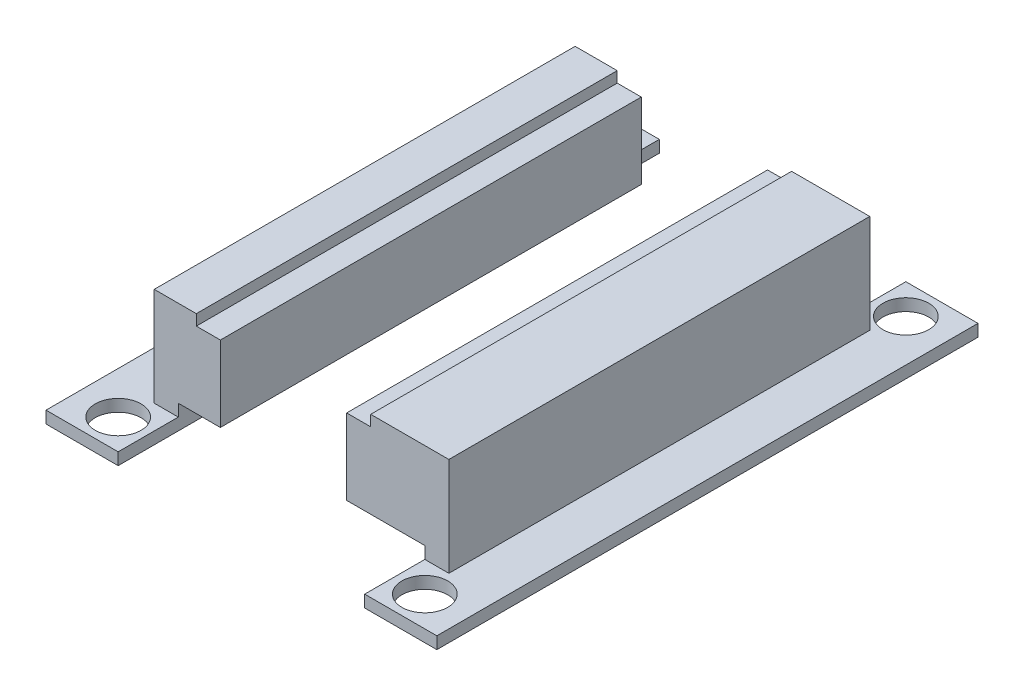
ISO-10303-21;
HEADER;
FILE_DESCRIPTION(('STEP AP214'),'2;1');
FILE_NAME('part.step','',(''),(''),'','','');
FILE_SCHEMA(('AUTOMOTIVE_DESIGN { 1 0 10303 214 1 1 1 1 }'));
ENDSEC;
DATA;
#1=APPLICATION_CONTEXT('core data for automotive mechanical design processes');
#2=APPLICATION_PROTOCOL_DEFINITION('international standard','automotive_design',2000,#1);
#3=PRODUCT_CONTEXT('',#1,'mechanical');
#4=PRODUCT('Part','Part','',(#3));
#5=PRODUCT_RELATED_PRODUCT_CATEGORY('part','',(#4));
#6=PRODUCT_DEFINITION_FORMATION('','',#4);
#7=PRODUCT_DEFINITION_CONTEXT('part definition',#1,'design');
#8=PRODUCT_DEFINITION('design','',#6,#7);
#9=PRODUCT_DEFINITION_SHAPE('','',#8);
#10=(LENGTH_UNIT() NAMED_UNIT(*) SI_UNIT(.MILLI.,.METRE.));
#11=(NAMED_UNIT(*) PLANE_ANGLE_UNIT() SI_UNIT($,.RADIAN.));
#12=(NAMED_UNIT(*) SI_UNIT($,.STERADIAN.) SOLID_ANGLE_UNIT());
#13=UNCERTAINTY_MEASURE_WITH_UNIT(LENGTH_MEASURE(1.E-05),#10,'distance_accuracy_value','');
#14=(GEOMETRIC_REPRESENTATION_CONTEXT(3) GLOBAL_UNCERTAINTY_ASSIGNED_CONTEXT((#13)) GLOBAL_UNIT_ASSIGNED_CONTEXT((#10,
#11,#12)) REPRESENTATION_CONTEXT('',''));
#15=CARTESIAN_POINT('',(0.,0.,0.));
#16=DIRECTION('',(0.,0.,1.));
#17=DIRECTION('',(1.,0.,0.));
#18=AXIS2_PLACEMENT_3D('',#15,#16,#17);
#19=CARTESIAN_POINT('',(16.25,0.,45.));
#20=DIRECTION('',(0.,1.,0.));
#21=DIRECTION('',(-1.,0.,0.));
#22=AXIS2_PLACEMENT_3D('',#19,#20,#21);
#23=PLANE('',#22);
#24=CARTESIAN_POINT('',(12.75,0.,2.5));
#25=DIRECTION('',(0.,1.,0.));
#26=DIRECTION('',(-1.,0.,0.));
#27=AXIS2_PLACEMENT_3D('',#24,#25,#26);
#28=CIRCLE('',#27,1.905);
#29=CARTESIAN_POINT('',(10.845,0.,2.5));
#30=VERTEX_POINT('',#29);
#31=EDGE_CURVE('E490',#30,#30,#28,.T.);
#32=ORIENTED_EDGE('',*,*,#31,.T.);
#33=EDGE_LOOP('',(#32));
#34=FACE_BOUND('',#33,.T.);
#35=CARTESIAN_POINT('',(12.75,0.,42.5));
#36=DIRECTION('',(0.,1.,0.));
#37=DIRECTION('',(-1.,0.,0.));
#38=AXIS2_PLACEMENT_3D('',#35,#36,#37);
#39=CIRCLE('',#38,1.905);
#40=CARTESIAN_POINT('',(10.845,0.,42.5));
#41=VERTEX_POINT('',#40);
#42=EDGE_CURVE('E263',#41,#41,#39,.T.);
#43=ORIENTED_EDGE('',*,*,#42,.T.);
#44=EDGE_LOOP('',(#43));
#45=FACE_BOUND('',#44,.T.);
#46=DIRECTION('',(1.,0.,0.));
#47=VECTOR('',#46,1.);
#48=CARTESIAN_POINT('',(16.25,0.,0.));
#49=LINE('',#48,#47);
#50=CARTESIAN_POINT('',(10.25,0.,0.));
#51=VERTEX_POINT('',#50);
#52=CARTESIAN_POINT('',(16.25,0.,0.));
#53=VERTEX_POINT('',#52);
#54=EDGE_CURVE('E220',#51,#53,#49,.T.);
#55=ORIENTED_EDGE('',*,*,#54,.T.);
#56=DIRECTION('',(0.,0.,-1.));
#57=VECTOR('',#56,1.);
#58=CARTESIAN_POINT('',(16.25,0.,45.));
#59=LINE('',#58,#57);
#60=CARTESIAN_POINT('',(16.25,0.,45.));
#61=VERTEX_POINT('',#60);
#62=EDGE_CURVE('E295',#61,#53,#59,.T.);
#63=ORIENTED_EDGE('',*,*,#62,.F.);
#64=DIRECTION('',(1.,0.,0.));
#65=VECTOR('',#64,1.);
#66=CARTESIAN_POINT('',(16.25,0.,45.));
#67=LINE('',#66,#65);
#68=CARTESIAN_POINT('',(10.25,0.,45.));
#69=VERTEX_POINT('',#68);
#70=EDGE_CURVE('E215',#69,#61,#67,.T.);
#71=ORIENTED_EDGE('',*,*,#70,.F.);
#72=DIRECTION('',(0.,0.,-1.));
#73=VECTOR('',#72,1.);
#74=CARTESIAN_POINT('',(10.25,0.,45.));
#75=LINE('',#74,#73);
#76=EDGE_CURVE('E208',#69,#51,#75,.T.);
#77=ORIENTED_EDGE('',*,*,#76,.T.);
#78=EDGE_LOOP('',(#55,#63,#71,#77));
#79=FACE_BOUND('',#78,.T.);
#80=ADVANCED_FACE('F53',(#34,#45,#79),#23,.F.);
#81=CARTESIAN_POINT('',(16.25,1.,45.));
#82=DIRECTION('',(-1.,0.,0.));
#83=DIRECTION('',(0.,0.,1.));
#84=AXIS2_PLACEMENT_3D('',#81,#82,#83);
#85=PLANE('',#84);
#86=DIRECTION('',(0.,1.,0.));
#87=VECTOR('',#86,1.);
#88=CARTESIAN_POINT('',(16.25,1.,0.));
#89=LINE('',#88,#87);
#90=CARTESIAN_POINT('',(16.25,1.,0.));
#91=VERTEX_POINT('',#90);
#92=EDGE_CURVE('E78',#53,#91,#89,.T.);
#93=ORIENTED_EDGE('',*,*,#92,.T.);
#94=DIRECTION('',(0.,0.,-1.));
#95=VECTOR('',#94,1.);
#96=CARTESIAN_POINT('',(16.25,1.,45.));
#97=LINE('',#96,#95);
#98=CARTESIAN_POINT('',(16.25,1.,45.));
#99=VERTEX_POINT('',#98);
#100=EDGE_CURVE('E189',#99,#91,#97,.T.);
#101=ORIENTED_EDGE('',*,*,#100,.F.);
#102=DIRECTION('',(0.,1.,0.));
#103=VECTOR('',#102,1.);
#104=CARTESIAN_POINT('',(16.25,1.,45.));
#105=LINE('',#104,#103);
#106=EDGE_CURVE('E92',#61,#99,#105,.T.);
#107=ORIENTED_EDGE('',*,*,#106,.F.);
#108=ORIENTED_EDGE('',*,*,#62,.T.);
#109=EDGE_LOOP('',(#93,#101,#107,#108));
#110=FACE_BOUND('',#109,.T.);
#111=ADVANCED_FACE('F313',(#110),#85,.F.);
#112=CARTESIAN_POINT('',(12.25,1.,45.));
#113=DIRECTION('',(0.,-1.,0.));
#114=DIRECTION('',(1.,0.,0.));
#115=AXIS2_PLACEMENT_3D('',#112,#113,#114);
#116=PLANE('',#115);
#117=CARTESIAN_POINT('',(12.75,1.,2.5));
#118=DIRECTION('',(0.,1.,0.));
#119=DIRECTION('',(-1.,0.,0.));
#120=AXIS2_PLACEMENT_3D('',#117,#118,#119);
#121=CIRCLE('',#120,1.905);
#122=CARTESIAN_POINT('',(10.845,1.,2.5));
#123=VERTEX_POINT('',#122);
#124=EDGE_CURVE('E177',#123,#123,#121,.T.);
#125=ORIENTED_EDGE('',*,*,#124,.F.);
#126=EDGE_LOOP('',(#125));
#127=FACE_BOUND('',#126,.T.);
#128=CARTESIAN_POINT('',(12.75,1.,42.5));
#129=DIRECTION('',(0.,1.,0.));
#130=DIRECTION('',(-1.,0.,0.));
#131=AXIS2_PLACEMENT_3D('',#128,#129,#130);
#132=CIRCLE('',#131,1.905);
#133=CARTESIAN_POINT('',(10.845,1.,42.5));
#134=VERTEX_POINT('',#133);
#135=EDGE_CURVE('E264',#134,#134,#132,.T.);
#136=ORIENTED_EDGE('',*,*,#135,.F.);
#137=EDGE_LOOP('',(#136));
#138=FACE_BOUND('',#137,.T.);
#139=DIRECTION('',(-1.,0.,0.));
#140=VECTOR('',#139,1.);
#141=CARTESIAN_POINT('',(12.25,1.,0.));
#142=LINE('',#141,#140);
#143=CARTESIAN_POINT('',(10.25,0.999999999999999,0.));
#144=VERTEX_POINT('',#143);
#145=EDGE_CURVE('E214',#91,#144,#142,.T.);
#146=ORIENTED_EDGE('',*,*,#145,.T.);
#147=DIRECTION('',(0.,0.,-1.));
#148=VECTOR('',#147,1.);
#149=CARTESIAN_POINT('',(10.25,0.999999999999999,45.));
#150=LINE('',#149,#148);
#151=CARTESIAN_POINT('',(10.25,0.999999999999999,5.));
#152=VERTEX_POINT('',#151);
#153=EDGE_CURVE('E250',#152,#144,#150,.T.);
#154=ORIENTED_EDGE('',*,*,#153,.F.);
#155=DIRECTION('',(1.,0.,0.));
#156=VECTOR('',#155,1.);
#157=CARTESIAN_POINT('',(-16.25,0.999999999999993,5.));
#158=LINE('',#157,#156);
#159=CARTESIAN_POINT('',(12.25,0.999999999999999,5.));
#160=VERTEX_POINT('',#159);
#161=EDGE_CURVE('E167',#152,#160,#158,.T.);
#162=ORIENTED_EDGE('',*,*,#161,.T.);
#163=DIRECTION('',(0.,0.,-1.));
#164=VECTOR('',#163,1.);
#165=CARTESIAN_POINT('',(12.25,1.,45.));
#166=LINE('',#165,#164);
#167=CARTESIAN_POINT('',(12.25,1.,40.));
#168=VERTEX_POINT('',#167);
#169=EDGE_CURVE('E175',#168,#160,#166,.T.);
#170=ORIENTED_EDGE('',*,*,#169,.F.);
#171=DIRECTION('',(1.,0.,0.));
#172=VECTOR('',#171,1.);
#173=CARTESIAN_POINT('',(-16.25,0.999999999999994,40.));
#174=LINE('',#173,#172);
#175=CARTESIAN_POINT('',(10.25,1.,40.));
#176=VERTEX_POINT('',#175);
#177=EDGE_CURVE('E274',#176,#168,#174,.T.);
#178=ORIENTED_EDGE('',*,*,#177,.F.);
#179=DIRECTION('',(0.,0.,-1.));
#180=VECTOR('',#179,1.);
#181=CARTESIAN_POINT('',(10.25,1.,45.));
#182=LINE('',#181,#180);
#183=CARTESIAN_POINT('',(10.25,0.999999999999999,45.));
#184=VERTEX_POINT('',#183);
#185=EDGE_CURVE('E237',#184,#176,#182,.T.);
#186=ORIENTED_EDGE('',*,*,#185,.F.);
#187=DIRECTION('',(-1.,0.,0.));
#188=VECTOR('',#187,1.);
#189=CARTESIAN_POINT('',(12.25,1.,45.));
#190=LINE('',#189,#188);
#191=EDGE_CURVE('E69',#99,#184,#190,.T.);
#192=ORIENTED_EDGE('',*,*,#191,.F.);
#193=ORIENTED_EDGE('',*,*,#100,.T.);
#194=EDGE_LOOP('',(#146,#154,#162,#170,#178,#186,#192,#193));
#195=FACE_BOUND('',#194,.T.);
#196=ADVANCED_FACE('F300',(#127,#138,#195),#116,.F.);
#197=CARTESIAN_POINT('',(12.25,9.2,45.));
#198=DIRECTION('',(-1.,0.,0.));
#199=DIRECTION('',(0.,-1.,0.));
#200=AXIS2_PLACEMENT_3D('',#197,#198,#199);
#201=PLANE('',#200);
#202=ORIENTED_EDGE('',*,*,#169,.T.);
#203=DIRECTION('',(0.,-1.,0.));
#204=VECTOR('',#203,1.);
#205=CARTESIAN_POINT('',(12.25,0.999999999999999,5.));
#206=LINE('',#205,#204);
#207=CARTESIAN_POINT('',(12.25,9.2,5.));
#208=VERTEX_POINT('',#207);
#209=EDGE_CURVE('E158',#208,#160,#206,.T.);
#210=ORIENTED_EDGE('',*,*,#209,.F.);
#211=DIRECTION('',(0.,0.,-1.));
#212=VECTOR('',#211,1.);
#213=CARTESIAN_POINT('',(12.25,9.2,45.));
#214=LINE('',#213,#212);
#215=CARTESIAN_POINT('',(12.25,9.2,40.));
#216=VERTEX_POINT('',#215);
#217=EDGE_CURVE('E173',#216,#208,#214,.T.);
#218=ORIENTED_EDGE('',*,*,#217,.F.);
#219=DIRECTION('',(0.,1.,0.));
#220=VECTOR('',#219,1.);
#221=CARTESIAN_POINT('',(12.25,1.,40.));
#222=LINE('',#221,#220);
#223=EDGE_CURVE('E268',#168,#216,#222,.T.);
#224=ORIENTED_EDGE('',*,*,#223,.F.);
#225=EDGE_LOOP('',(#202,#210,#218,#224));
#226=FACE_BOUND('',#225,.T.);
#227=ADVANCED_FACE('F171',(#226),#201,.F.);
#228=CARTESIAN_POINT('',(5.75,9.2,45.));
#229=DIRECTION('',(0.,-1.,0.));
#230=DIRECTION('',(0.,0.,-1.));
#231=AXIS2_PLACEMENT_3D('',#228,#229,#230);
#232=PLANE('',#231);
#233=ORIENTED_EDGE('',*,*,#217,.T.);
#234=DIRECTION('',(1.,0.,0.));
#235=VECTOR('',#234,1.);
#236=CARTESIAN_POINT('',(-16.25,9.19999999999999,5.));
#237=LINE('',#236,#235);
#238=CARTESIAN_POINT('',(5.75,9.2,5.));
#239=VERTEX_POINT('',#238);
#240=EDGE_CURVE('E154',#239,#208,#237,.T.);
#241=ORIENTED_EDGE('',*,*,#240,.F.);
#242=DIRECTION('',(0.,0.,-1.));
#243=VECTOR('',#242,1.);
#244=CARTESIAN_POINT('',(5.75,9.2,45.));
#245=LINE('',#244,#243);
#246=CARTESIAN_POINT('',(5.75,9.2,40.));
#247=VERTEX_POINT('',#246);
#248=EDGE_CURVE('E183',#247,#239,#245,.T.);
#249=ORIENTED_EDGE('',*,*,#248,.F.);
#250=DIRECTION('',(1.,0.,0.));
#251=VECTOR('',#250,1.);
#252=CARTESIAN_POINT('',(-16.25,9.19999999999999,40.));
#253=LINE('',#252,#251);
#254=EDGE_CURVE('E181',#247,#216,#253,.T.);
#255=ORIENTED_EDGE('',*,*,#254,.T.);
#256=EDGE_LOOP('',(#233,#241,#249,#255));
#257=FACE_BOUND('',#256,.T.);
#258=ADVANCED_FACE('F180',(#257),#232,.F.);
#259=CARTESIAN_POINT('',(5.75,8.3,45.));
#260=DIRECTION('',(1.,0.,0.));
#261=DIRECTION('',(0.,0.,-1.));
#262=AXIS2_PLACEMENT_3D('',#259,#260,#261);
#263=PLANE('',#262);
#264=ORIENTED_EDGE('',*,*,#248,.T.);
#265=DIRECTION('',(0.,-1.,0.));
#266=VECTOR('',#265,1.);
#267=CARTESIAN_POINT('',(5.75,8.3,5.));
#268=LINE('',#267,#266);
#269=CARTESIAN_POINT('',(5.75,8.3,5.));
#270=VERTEX_POINT('',#269);
#271=EDGE_CURVE('E161',#239,#270,#268,.T.);
#272=ORIENTED_EDGE('',*,*,#271,.T.);
#273=DIRECTION('',(0.,0.,-1.));
#274=VECTOR('',#273,1.);
#275=CARTESIAN_POINT('',(5.75,8.3,45.));
#276=LINE('',#275,#274);
#277=CARTESIAN_POINT('',(5.75,8.3,40.));
#278=VERTEX_POINT('',#277);
#279=EDGE_CURVE('E187',#278,#270,#276,.T.);
#280=ORIENTED_EDGE('',*,*,#279,.F.);
#281=DIRECTION('',(0.,1.,0.));
#282=VECTOR('',#281,1.);
#283=CARTESIAN_POINT('',(5.75,8.3,40.));
#284=LINE('',#283,#282);
#285=EDGE_CURVE('E291',#278,#247,#284,.T.);
#286=ORIENTED_EDGE('',*,*,#285,.T.);
#287=EDGE_LOOP('',(#264,#272,#280,#286));
#288=FACE_BOUND('',#287,.T.);
#289=ADVANCED_FACE('F332',(#288),#263,.F.);
#290=CARTESIAN_POINT('',(3.75,8.3,45.));
#291=DIRECTION('',(0.,-1.,0.));
#292=DIRECTION('',(0.,0.,-1.));
#293=AXIS2_PLACEMENT_3D('',#290,#291,#292);
#294=PLANE('',#293);
#295=ORIENTED_EDGE('',*,*,#279,.T.);
#296=DIRECTION('',(-1.,0.,0.));
#297=VECTOR('',#296,1.);
#298=CARTESIAN_POINT('',(3.75,8.3,5.));
#299=LINE('',#298,#297);
#300=CARTESIAN_POINT('',(3.75,8.3,5.));
#301=VERTEX_POINT('',#300);
#302=EDGE_CURVE('E254',#270,#301,#299,.T.);
#303=ORIENTED_EDGE('',*,*,#302,.T.);
#304=DIRECTION('',(0.,0.,-1.));
#305=VECTOR('',#304,1.);
#306=CARTESIAN_POINT('',(3.75,8.3,45.));
#307=LINE('',#306,#305);
#308=CARTESIAN_POINT('',(3.75,8.3,40.));
#309=VERTEX_POINT('',#308);
#310=EDGE_CURVE('E196',#309,#301,#307,.T.);
#311=ORIENTED_EDGE('',*,*,#310,.F.);
#312=DIRECTION('',(1.,0.,0.));
#313=VECTOR('',#312,1.);
#314=CARTESIAN_POINT('',(3.75,8.3,40.));
#315=LINE('',#314,#313);
#316=EDGE_CURVE('E287',#309,#278,#315,.T.);
#317=ORIENTED_EDGE('',*,*,#316,.T.);
#318=EDGE_LOOP('',(#295,#303,#311,#317));
#319=FACE_BOUND('',#318,.T.);
#320=ADVANCED_FACE('F335',(#319),#294,.F.);
#321=CARTESIAN_POINT('',(3.75,2.,45.));
#322=DIRECTION('',(1.,0.,0.));
#323=DIRECTION('',(0.,0.,-1.));
#324=AXIS2_PLACEMENT_3D('',#321,#322,#323);
#325=PLANE('',#324);
#326=ORIENTED_EDGE('',*,*,#310,.T.);
#327=DIRECTION('',(0.,-1.,0.));
#328=VECTOR('',#327,1.);
#329=CARTESIAN_POINT('',(3.75,2.,5.));
#330=LINE('',#329,#328);
#331=CARTESIAN_POINT('',(3.75,2.,5.));
#332=VERTEX_POINT('',#331);
#333=EDGE_CURVE('E249',#301,#332,#330,.T.);
#334=ORIENTED_EDGE('',*,*,#333,.T.);
#335=DIRECTION('',(0.,0.,-1.));
#336=VECTOR('',#335,1.);
#337=CARTESIAN_POINT('',(3.75,2.,45.));
#338=LINE('',#337,#336);
#339=CARTESIAN_POINT('',(3.75,2.,40.));
#340=VERTEX_POINT('',#339);
#341=EDGE_CURVE('E200',#340,#332,#338,.T.);
#342=ORIENTED_EDGE('',*,*,#341,.F.);
#343=DIRECTION('',(0.,1.,0.));
#344=VECTOR('',#343,1.);
#345=CARTESIAN_POINT('',(3.75,2.,40.));
#346=LINE('',#345,#344);
#347=EDGE_CURVE('E283',#340,#309,#346,.T.);
#348=ORIENTED_EDGE('',*,*,#347,.T.);
#349=EDGE_LOOP('',(#326,#334,#342,#348));
#350=FACE_BOUND('',#349,.T.);
#351=ADVANCED_FACE('F339',(#350),#325,.F.);
#352=CARTESIAN_POINT('',(10.25,2.,45.));
#353=DIRECTION('',(0.,1.,0.));
#354=DIRECTION('',(-1.,0.,0.));
#355=AXIS2_PLACEMENT_3D('',#352,#353,#354);
#356=PLANE('',#355);
#357=ORIENTED_EDGE('',*,*,#341,.T.);
#358=DIRECTION('',(1.,0.,0.));
#359=VECTOR('',#358,1.);
#360=CARTESIAN_POINT('',(10.25,2.,5.));
#361=LINE('',#360,#359);
#362=CARTESIAN_POINT('',(10.25,2.,5.));
#363=VERTEX_POINT('',#362);
#364=EDGE_CURVE('E246',#332,#363,#361,.T.);
#365=ORIENTED_EDGE('',*,*,#364,.T.);
#366=DIRECTION('',(0.,0.,-1.));
#367=VECTOR('',#366,1.);
#368=CARTESIAN_POINT('',(10.25,2.,45.));
#369=LINE('',#368,#367);
#370=CARTESIAN_POINT('',(10.25,2.,40.));
#371=VERTEX_POINT('',#370);
#372=EDGE_CURVE('E204',#371,#363,#369,.T.);
#373=ORIENTED_EDGE('',*,*,#372,.F.);
#374=DIRECTION('',(-1.,0.,0.));
#375=VECTOR('',#374,1.);
#376=CARTESIAN_POINT('',(10.25,2.,40.));
#377=LINE('',#376,#375);
#378=EDGE_CURVE('E244',#371,#340,#377,.T.);
#379=ORIENTED_EDGE('',*,*,#378,.T.);
#380=EDGE_LOOP('',(#357,#365,#373,#379));
#381=FACE_BOUND('',#380,.T.);
#382=ADVANCED_FACE('F243',(#381),#356,.F.);
#383=CARTESIAN_POINT('',(10.25,0.,45.));
#384=DIRECTION('',(1.,0.,0.));
#385=DIRECTION('',(0.,0.,-1.));
#386=AXIS2_PLACEMENT_3D('',#383,#384,#385);
#387=PLANE('',#386);
#388=DIRECTION('',(0.,-1.,0.));
#389=VECTOR('',#388,1.);
#390=CARTESIAN_POINT('',(10.25,0.,5.));
#391=LINE('',#390,#389);
#392=EDGE_CURVE('E12',#363,#152,#391,.T.);
#393=ORIENTED_EDGE('',*,*,#392,.T.);
#394=ORIENTED_EDGE('',*,*,#153,.T.);
#395=DIRECTION('',(0.,-1.,0.));
#396=VECTOR('',#395,1.);
#397=CARTESIAN_POINT('',(10.25,0.,0.));
#398=LINE('',#397,#396);
#399=EDGE_CURVE('E99',#144,#51,#398,.T.);
#400=ORIENTED_EDGE('',*,*,#399,.T.);
#401=ORIENTED_EDGE('',*,*,#76,.F.);
#402=DIRECTION('',(0.,-1.,0.));
#403=VECTOR('',#402,1.);
#404=CARTESIAN_POINT('',(10.25,0.,45.));
#405=LINE('',#404,#403);
#406=EDGE_CURVE('E211',#184,#69,#405,.T.);
#407=ORIENTED_EDGE('',*,*,#406,.F.);
#408=ORIENTED_EDGE('',*,*,#185,.T.);
#409=DIRECTION('',(0.,1.,0.));
#410=VECTOR('',#409,1.);
#411=CARTESIAN_POINT('',(10.25,0.,40.));
#412=LINE('',#411,#410);
#413=EDGE_CURVE('E62',#176,#371,#412,.T.);
#414=ORIENTED_EDGE('',*,*,#413,.T.);
#415=ORIENTED_EDGE('',*,*,#372,.T.);
#416=EDGE_LOOP('',(#393,#394,#400,#401,#407,#408,#414,#415));
#417=FACE_BOUND('',#416,.T.);
#418=ADVANCED_FACE('F235',(#417),#387,.F.);
#419=CARTESIAN_POINT('',(0.,0.,45.));
#420=DIRECTION('',(0.,0.,-1.));
#421=DIRECTION('',(-1.,0.,0.));
#422=AXIS2_PLACEMENT_3D('',#419,#420,#421);
#423=PLANE('',#422);
#424=ORIENTED_EDGE('',*,*,#191,.T.);
#425=ORIENTED_EDGE('',*,*,#406,.T.);
#426=ORIENTED_EDGE('',*,*,#70,.T.);
#427=ORIENTED_EDGE('',*,*,#106,.T.);
#428=EDGE_LOOP('',(#424,#425,#426,#427));
#429=FACE_BOUND('',#428,.T.);
#430=ADVANCED_FACE('F55',(#429),#423,.F.);
#431=CARTESIAN_POINT('',(0.,0.,0.));
#432=DIRECTION('',(0.,0.,-1.));
#433=DIRECTION('',(-1.,0.,0.));
#434=AXIS2_PLACEMENT_3D('',#431,#432,#433);
#435=PLANE('',#434);
#436=ORIENTED_EDGE('',*,*,#399,.F.);
#437=ORIENTED_EDGE('',*,*,#145,.F.);
#438=ORIENTED_EDGE('',*,*,#92,.F.);
#439=ORIENTED_EDGE('',*,*,#54,.F.);
#440=EDGE_LOOP('',(#436,#437,#438,#439));
#441=FACE_BOUND('',#440,.T.);
#442=ADVANCED_FACE('F301',(#441),#435,.T.);
#443=CARTESIAN_POINT('',(-16.25,0.999999999999994,40.));
#444=DIRECTION('',(0.,0.,-1.));
#445=DIRECTION('',(-1.,0.,0.));
#446=AXIS2_PLACEMENT_3D('',#443,#444,#445);
#447=PLANE('',#446);
#448=ORIENTED_EDGE('',*,*,#316,.F.);
#449=ORIENTED_EDGE('',*,*,#347,.F.);
#450=ORIENTED_EDGE('',*,*,#378,.F.);
#451=ORIENTED_EDGE('',*,*,#413,.F.);
#452=ORIENTED_EDGE('',*,*,#177,.T.);
#453=ORIENTED_EDGE('',*,*,#223,.T.);
#454=ORIENTED_EDGE('',*,*,#254,.F.);
#455=ORIENTED_EDGE('',*,*,#285,.F.);
#456=EDGE_LOOP('',(#448,#449,#450,#451,#452,#453,#454,#455));
#457=FACE_BOUND('',#456,.T.);
#458=ADVANCED_FACE('F310',(#457),#447,.F.);
#459=CARTESIAN_POINT('',(12.75,0.,42.5));
#460=DIRECTION('',(0.,1.,0.));
#461=DIRECTION('',(-1.,0.,0.));
#462=AXIS2_PLACEMENT_3D('',#459,#460,#461);
#463=CYLINDRICAL_SURFACE('',#462,1.905);
#464=ORIENTED_EDGE('',*,*,#42,.F.);
#465=EDGE_LOOP('',(#464));
#466=FACE_BOUND('',#465,.T.);
#467=ORIENTED_EDGE('',*,*,#135,.T.);
#468=EDGE_LOOP('',(#467));
#469=FACE_BOUND('',#468,.T.);
#470=ADVANCED_FACE('F373',(#466,#469),#463,.F.);
#471=CARTESIAN_POINT('',(-16.25,0.999999999999993,5.));
#472=DIRECTION('',(0.,0.,1.));
#473=DIRECTION('',(1.,0.,0.));
#474=AXIS2_PLACEMENT_3D('',#471,#472,#473);
#475=PLANE('',#474);
#476=ORIENTED_EDGE('',*,*,#240,.T.);
#477=ORIENTED_EDGE('',*,*,#209,.T.);
#478=ORIENTED_EDGE('',*,*,#161,.F.);
#479=ORIENTED_EDGE('',*,*,#392,.F.);
#480=ORIENTED_EDGE('',*,*,#364,.F.);
#481=ORIENTED_EDGE('',*,*,#333,.F.);
#482=ORIENTED_EDGE('',*,*,#302,.F.);
#483=ORIENTED_EDGE('',*,*,#271,.F.);
#484=EDGE_LOOP('',(#476,#477,#478,#479,#480,#481,#482,#483));
#485=FACE_BOUND('',#484,.T.);
#486=ADVANCED_FACE('F156',(#485),#475,.F.);
#487=CARTESIAN_POINT('',(12.75,0.,2.5));
#488=DIRECTION('',(0.,1.,0.));
#489=DIRECTION('',(-1.,0.,0.));
#490=AXIS2_PLACEMENT_3D('',#487,#488,#489);
#491=CYLINDRICAL_SURFACE('',#490,1.905);
#492=ORIENTED_EDGE('',*,*,#31,.F.);
#493=EDGE_LOOP('',(#492));
#494=FACE_BOUND('',#493,.T.);
#495=ORIENTED_EDGE('',*,*,#124,.T.);
#496=EDGE_LOOP('',(#495));
#497=FACE_BOUND('',#496,.T.);
#498=ADVANCED_FACE('F372',(#494,#497),#491,.F.);
#499=CLOSED_SHELL('',(#80,#111,#196,#227,#258,#289,#320,#351,#382,#418,#430,#442,#458,#470,#486,#498));
#500=MANIFOLD_SOLID_BREP('B2',#499);
#501=CARTESIAN_POINT('',(-16.25,1.,45.));
#502=DIRECTION('',(1.,0.,0.));
#503=DIRECTION('',(0.,0.,-1.));
#504=AXIS2_PLACEMENT_3D('',#501,#502,#503);
#505=PLANE('',#504);
#506=DIRECTION('',(0.,-1.,0.));
#507=VECTOR('',#506,1.);
#508=CARTESIAN_POINT('',(-16.25,1.,0.));
#509=LINE('',#508,#507);
#510=CARTESIAN_POINT('',(-16.25,1.,0.));
#511=VERTEX_POINT('',#510);
#512=CARTESIAN_POINT('',(-16.25,0.,0.));
#513=VERTEX_POINT('',#512);
#514=EDGE_CURVE('E660',#511,#513,#509,.T.);
#515=ORIENTED_EDGE('',*,*,#514,.T.);
#516=DIRECTION('',(0.,0.,-1.));
#517=VECTOR('',#516,1.);
#518=CARTESIAN_POINT('',(-16.25,0.,45.));
#519=LINE('',#518,#517);
#520=CARTESIAN_POINT('',(-16.25,0.,45.));
#521=VERTEX_POINT('',#520);
#522=EDGE_CURVE('E51',#521,#513,#519,.T.);
#523=ORIENTED_EDGE('',*,*,#522,.F.);
#524=DIRECTION('',(0.,-1.,0.));
#525=VECTOR('',#524,1.);
#526=CARTESIAN_POINT('',(-16.25,1.,45.));
#527=LINE('',#526,#525);
#528=CARTESIAN_POINT('',(-16.25,1.,45.));
#529=VERTEX_POINT('',#528);
#530=EDGE_CURVE('E658',#529,#521,#527,.T.);
#531=ORIENTED_EDGE('',*,*,#530,.F.);
#532=DIRECTION('',(0.,0.,-1.));
#533=VECTOR('',#532,1.);
#534=CARTESIAN_POINT('',(-16.25,1.,45.));
#535=LINE('',#534,#533);
#536=EDGE_CURVE('E546',#529,#511,#535,.T.);
#537=ORIENTED_EDGE('',*,*,#536,.T.);
#538=EDGE_LOOP('',(#515,#523,#531,#537));
#539=FACE_BOUND('',#538,.T.);
#540=ADVANCED_FACE('F505',(#539),#505,.F.);
#541=CARTESIAN_POINT('',(-16.25,0.,45.));
#542=DIRECTION('',(0.,1.,0.));
#543=DIRECTION('',(-1.,0.,0.));
#544=AXIS2_PLACEMENT_3D('',#541,#542,#543);
#545=PLANE('',#544);
#546=CARTESIAN_POINT('',(-12.75,0.,2.5));
#547=DIRECTION('',(0.,1.,0.));
#548=DIRECTION('',(-1.,0.,0.));
#549=AXIS2_PLACEMENT_3D('',#546,#547,#548);
#550=CIRCLE('',#549,1.905);
#551=CARTESIAN_POINT('',(-14.655,0.,2.5));
#552=VERTEX_POINT('',#551);
#553=EDGE_CURVE('E624',#552,#552,#550,.T.);
#554=ORIENTED_EDGE('',*,*,#553,.T.);
#555=EDGE_LOOP('',(#554));
#556=FACE_BOUND('',#555,.T.);
#557=CARTESIAN_POINT('',(-12.75,0.,42.5));
#558=DIRECTION('',(0.,1.,0.));
#559=DIRECTION('',(-1.,0.,0.));
#560=AXIS2_PLACEMENT_3D('',#557,#558,#559);
#561=CIRCLE('',#560,1.905);
#562=CARTESIAN_POINT('',(-14.655,0.,42.5));
#563=VERTEX_POINT('',#562);
#564=EDGE_CURVE('E756',#563,#563,#561,.T.);
#565=ORIENTED_EDGE('',*,*,#564,.T.);
#566=EDGE_LOOP('',(#565));
#567=FACE_BOUND('',#566,.T.);
#568=DIRECTION('',(1.,0.,0.));
#569=VECTOR('',#568,1.);
#570=CARTESIAN_POINT('',(-16.25,0.,0.));
#571=LINE('',#570,#569);
#572=CARTESIAN_POINT('',(-10.25,0.,0.));
#573=VERTEX_POINT('',#572);
#574=EDGE_CURVE('E656',#513,#573,#571,.T.);
#575=ORIENTED_EDGE('',*,*,#574,.T.);
#576=DIRECTION('',(0.,0.,-1.));
#577=VECTOR('',#576,1.);
#578=CARTESIAN_POINT('',(-10.25,0.,45.));
#579=LINE('',#578,#577);
#580=CARTESIAN_POINT('',(-10.25,0.,45.));
#581=VERTEX_POINT('',#580);
#582=EDGE_CURVE('E512',#581,#573,#579,.T.);
#583=ORIENTED_EDGE('',*,*,#582,.F.);
#584=DIRECTION('',(1.,0.,0.));
#585=VECTOR('',#584,1.);
#586=CARTESIAN_POINT('',(-16.25,0.,45.));
#587=LINE('',#586,#585);
#588=EDGE_CURVE('E550',#521,#581,#587,.T.);
#589=ORIENTED_EDGE('',*,*,#588,.F.);
#590=ORIENTED_EDGE('',*,*,#522,.T.);
#591=EDGE_LOOP('',(#575,#583,#589,#590));
#592=FACE_BOUND('',#591,.T.);
#593=ADVANCED_FACE('F678',(#556,#567,#592),#545,.F.);
#594=CARTESIAN_POINT('',(-10.25,2.,45.));
#595=DIRECTION('',(-1.,0.,0.));
#596=DIRECTION('',(0.,0.,1.));
#597=AXIS2_PLACEMENT_3D('',#594,#595,#596);
#598=PLANE('',#597);
#599=DIRECTION('',(0.,1.,0.));
#600=VECTOR('',#599,1.);
#601=CARTESIAN_POINT('',(-10.25,2.,0.));
#602=LINE('',#601,#600);
#603=CARTESIAN_POINT('',(-10.25,0.999999999999994,0.));
#604=VERTEX_POINT('',#603);
#605=EDGE_CURVE('E652',#573,#604,#602,.T.);
#606=ORIENTED_EDGE('',*,*,#605,.T.);
#607=DIRECTION('',(0.,0.,1.));
#608=VECTOR('',#607,1.);
#609=CARTESIAN_POINT('',(-10.25,0.999999999999995,45.));
#610=LINE('',#609,#608);
#611=CARTESIAN_POINT('',(-10.25,0.999999999999995,5.));
#612=VERTEX_POINT('',#611);
#613=EDGE_CURVE('E614',#604,#612,#610,.T.);
#614=ORIENTED_EDGE('',*,*,#613,.T.);
#615=DIRECTION('',(0.,1.,0.));
#616=VECTOR('',#615,1.);
#617=CARTESIAN_POINT('',(-10.25,2.,5.));
#618=LINE('',#617,#616);
#619=CARTESIAN_POINT('',(-10.25,2.,5.));
#620=VERTEX_POINT('',#619);
#621=EDGE_CURVE('E752',#612,#620,#618,.T.);
#622=ORIENTED_EDGE('',*,*,#621,.T.);
#623=DIRECTION('',(0.,0.,-1.));
#624=VECTOR('',#623,1.);
#625=CARTESIAN_POINT('',(-10.25,2.,45.));
#626=LINE('',#625,#624);
#627=CARTESIAN_POINT('',(-10.25,2.,40.));
#628=VERTEX_POINT('',#627);
#629=EDGE_CURVE('E644',#628,#620,#626,.T.);
#630=ORIENTED_EDGE('',*,*,#629,.F.);
#631=DIRECTION('',(0.,-1.,0.));
#632=VECTOR('',#631,1.);
#633=CARTESIAN_POINT('',(-10.25,2.,40.));
#634=LINE('',#633,#632);
#635=CARTESIAN_POINT('',(-10.25,0.999999999999995,40.));
#636=VERTEX_POINT('',#635);
#637=EDGE_CURVE('E666',#628,#636,#634,.T.);
#638=ORIENTED_EDGE('',*,*,#637,.T.);
#639=DIRECTION('',(0.,0.,1.));
#640=VECTOR('',#639,1.);
#641=CARTESIAN_POINT('',(-10.25,0.999999999999995,45.));
#642=LINE('',#641,#640);
#643=CARTESIAN_POINT('',(-10.25,0.999999999999995,45.));
#644=VERTEX_POINT('',#643);
#645=EDGE_CURVE('E764',#636,#644,#642,.T.);
#646=ORIENTED_EDGE('',*,*,#645,.T.);
#647=DIRECTION('',(0.,1.,0.));
#648=VECTOR('',#647,1.);
#649=CARTESIAN_POINT('',(-10.25,2.,45.));
#650=LINE('',#649,#648);
#651=EDGE_CURVE('E654',#581,#644,#650,.T.);
#652=ORIENTED_EDGE('',*,*,#651,.F.);
#653=ORIENTED_EDGE('',*,*,#582,.T.);
#654=EDGE_LOOP('',(#606,#614,#622,#630,#638,#646,#652,#653));
#655=FACE_BOUND('',#654,.T.);
#656=ADVANCED_FACE('F650',(#655),#598,.F.);
#657=CARTESIAN_POINT('',(-6.75,2.,45.));
#658=DIRECTION('',(0.,1.,0.));
#659=DIRECTION('',(-1.,0.,0.));
#660=AXIS2_PLACEMENT_3D('',#657,#658,#659);
#661=PLANE('',#660);
#662=ORIENTED_EDGE('',*,*,#629,.T.);
#663=DIRECTION('',(1.,0.,0.));
#664=VECTOR('',#663,1.);
#665=CARTESIAN_POINT('',(-6.75,2.,5.));
#666=LINE('',#665,#664);
#667=CARTESIAN_POINT('',(-6.75,2.,5.));
#668=VERTEX_POINT('',#667);
#669=EDGE_CURVE('E749',#620,#668,#666,.T.);
#670=ORIENTED_EDGE('',*,*,#669,.T.);
#671=DIRECTION('',(0.,0.,-1.));
#672=VECTOR('',#671,1.);
#673=CARTESIAN_POINT('',(-6.75,2.,45.));
#674=LINE('',#673,#672);
#675=CARTESIAN_POINT('',(-6.75,2.,40.));
#676=VERTEX_POINT('',#675);
#677=EDGE_CURVE('E641',#676,#668,#674,.T.);
#678=ORIENTED_EDGE('',*,*,#677,.F.);
#679=DIRECTION('',(-1.,0.,0.));
#680=VECTOR('',#679,1.);
#681=CARTESIAN_POINT('',(-6.75,2.,40.));
#682=LINE('',#681,#680);
#683=EDGE_CURVE('E669',#676,#628,#682,.T.);
#684=ORIENTED_EDGE('',*,*,#683,.T.);
#685=EDGE_LOOP('',(#662,#670,#678,#684));
#686=FACE_BOUND('',#685,.T.);
#687=ADVANCED_FACE('F685',(#686),#661,.F.);
#688=CARTESIAN_POINT('',(-6.75,8.3,45.));
#689=DIRECTION('',(-1.,0.,0.));
#690=DIRECTION('',(0.,-1.,0.));
#691=AXIS2_PLACEMENT_3D('',#688,#689,#690);
#692=PLANE('',#691);
#693=ORIENTED_EDGE('',*,*,#677,.T.);
#694=DIRECTION('',(0.,1.,0.));
#695=VECTOR('',#694,1.);
#696=CARTESIAN_POINT('',(-6.75,8.3,5.));
#697=LINE('',#696,#695);
#698=CARTESIAN_POINT('',(-6.75,8.3,5.));
#699=VERTEX_POINT('',#698);
#700=EDGE_CURVE('E746',#668,#699,#697,.T.);
#701=ORIENTED_EDGE('',*,*,#700,.T.);
#702=DIRECTION('',(0.,0.,-1.));
#703=VECTOR('',#702,1.);
#704=CARTESIAN_POINT('',(-6.75,8.3,45.));
#705=LINE('',#704,#703);
#706=CARTESIAN_POINT('',(-6.75,8.3,40.));
#707=VERTEX_POINT('',#706);
#708=EDGE_CURVE('E638',#707,#699,#705,.T.);
#709=ORIENTED_EDGE('',*,*,#708,.F.);
#710=DIRECTION('',(0.,-1.,0.));
#711=VECTOR('',#710,1.);
#712=CARTESIAN_POINT('',(-6.75,8.3,40.));
#713=LINE('',#712,#711);
#714=EDGE_CURVE('E673',#707,#676,#713,.T.);
#715=ORIENTED_EDGE('',*,*,#714,.T.);
#716=EDGE_LOOP('',(#693,#701,#709,#715));
#717=FACE_BOUND('',#716,.T.);
#718=ADVANCED_FACE('F692',(#717),#692,.F.);
#719=CARTESIAN_POINT('',(-6.75,8.3,45.));
#720=DIRECTION('',(0.,-1.,0.));
#721=DIRECTION('',(1.,0.,0.));
#722=AXIS2_PLACEMENT_3D('',#719,#720,#721);
#723=PLANE('',#722);
#724=ORIENTED_EDGE('',*,*,#708,.T.);
#725=DIRECTION('',(-1.,0.,0.));
#726=VECTOR('',#725,1.);
#727=CARTESIAN_POINT('',(-6.75,8.3,5.));
#728=LINE('',#727,#726);
#729=CARTESIAN_POINT('',(-8.75,8.29999999999999,5.));
#730=VERTEX_POINT('',#729);
#731=EDGE_CURVE('E743',#699,#730,#728,.T.);
#732=ORIENTED_EDGE('',*,*,#731,.T.);
#733=DIRECTION('',(0.,0.,-1.));
#734=VECTOR('',#733,1.);
#735=CARTESIAN_POINT('',(-8.75,8.29999999999999,45.));
#736=LINE('',#735,#734);
#737=CARTESIAN_POINT('',(-8.75,8.29999999999999,40.));
#738=VERTEX_POINT('',#737);
#739=EDGE_CURVE('E631',#738,#730,#736,.T.);
#740=ORIENTED_EDGE('',*,*,#739,.F.);
#741=DIRECTION('',(1.,0.,0.));
#742=VECTOR('',#741,1.);
#743=CARTESIAN_POINT('',(-6.75,8.3,40.));
#744=LINE('',#743,#742);
#745=EDGE_CURVE('E772',#738,#707,#744,.T.);
#746=ORIENTED_EDGE('',*,*,#745,.T.);
#747=EDGE_LOOP('',(#724,#732,#740,#746));
#748=FACE_BOUND('',#747,.T.);
#749=ADVANCED_FACE('F696',(#748),#723,.F.);
#750=CARTESIAN_POINT('',(-8.75,8.29999999999999,45.));
#751=DIRECTION('',(-1.,0.,0.));
#752=DIRECTION('',(0.,0.,1.));
#753=AXIS2_PLACEMENT_3D('',#750,#751,#752);
#754=PLANE('',#753);
#755=ORIENTED_EDGE('',*,*,#739,.T.);
#756=DIRECTION('',(0.,1.,0.));
#757=VECTOR('',#756,1.);
#758=CARTESIAN_POINT('',(-8.75,8.29999999999999,5.));
#759=LINE('',#758,#757);
#760=CARTESIAN_POINT('',(-8.75,9.19999999999999,5.));
#761=VERTEX_POINT('',#760);
#762=EDGE_CURVE('E613',#730,#761,#759,.T.);
#763=ORIENTED_EDGE('',*,*,#762,.T.);
#764=DIRECTION('',(0.,0.,-1.));
#765=VECTOR('',#764,1.);
#766=CARTESIAN_POINT('',(-8.75,9.19999999999999,45.));
#767=LINE('',#766,#765);
#768=CARTESIAN_POINT('',(-8.75,9.19999999999999,40.));
#769=VERTEX_POINT('',#768);
#770=EDGE_CURVE('E623',#769,#761,#767,.T.);
#771=ORIENTED_EDGE('',*,*,#770,.F.);
#772=DIRECTION('',(0.,-1.,0.));
#773=VECTOR('',#772,1.);
#774=CARTESIAN_POINT('',(-8.75,8.29999999999999,40.));
#775=LINE('',#774,#773);
#776=EDGE_CURVE('E769',#769,#738,#775,.T.);
#777=ORIENTED_EDGE('',*,*,#776,.T.);
#778=EDGE_LOOP('',(#755,#763,#771,#777));
#779=FACE_BOUND('',#778,.T.);
#780=ADVANCED_FACE('F700',(#779),#754,.F.);
#781=CARTESIAN_POINT('',(-8.75,9.19999999999999,45.));
#782=DIRECTION('',(0.,-1.,0.));
#783=DIRECTION('',(0.,0.,-1.));
#784=AXIS2_PLACEMENT_3D('',#781,#782,#783);
#785=PLANE('',#784);
#786=ORIENTED_EDGE('',*,*,#770,.T.);
#787=DIRECTION('',(1.,0.,0.));
#788=VECTOR('',#787,1.);
#789=CARTESIAN_POINT('',(-16.25,9.19999999999999,5.));
#790=LINE('',#789,#788);
#791=CARTESIAN_POINT('',(-12.25,9.19999999999999,5.));
#792=VERTEX_POINT('',#791);
#793=EDGE_CURVE('E605',#792,#761,#790,.T.);
#794=ORIENTED_EDGE('',*,*,#793,.F.);
#795=DIRECTION('',(0.,0.,-1.));
#796=VECTOR('',#795,1.);
#797=CARTESIAN_POINT('',(-12.25,9.19999999999999,45.));
#798=LINE('',#797,#796);
#799=CARTESIAN_POINT('',(-12.25,9.19999999999999,40.));
#800=VERTEX_POINT('',#799);
#801=EDGE_CURVE('E621',#800,#792,#798,.T.);
#802=ORIENTED_EDGE('',*,*,#801,.F.);
#803=DIRECTION('',(1.,0.,0.));
#804=VECTOR('',#803,1.);
#805=CARTESIAN_POINT('',(-16.25,9.19999999999999,40.));
#806=LINE('',#805,#804);
#807=EDGE_CURVE('E762',#800,#769,#806,.T.);
#808=ORIENTED_EDGE('',*,*,#807,.T.);
#809=EDGE_LOOP('',(#786,#794,#802,#808));
#810=FACE_BOUND('',#809,.T.);
#811=ADVANCED_FACE('F619',(#810),#785,.F.);
#812=CARTESIAN_POINT('',(-12.25,9.19999999999999,45.));
#813=DIRECTION('',(1.,0.,0.));
#814=DIRECTION('',(0.,1.,0.));
#815=AXIS2_PLACEMENT_3D('',#812,#813,#814);
#816=PLANE('',#815);
#817=ORIENTED_EDGE('',*,*,#801,.T.);
#818=DIRECTION('',(0.,-1.,0.));
#819=VECTOR('',#818,1.);
#820=CARTESIAN_POINT('',(-12.25,9.19999999999999,5.));
#821=LINE('',#820,#819);
#822=CARTESIAN_POINT('',(-12.25,0.999999999999994,5.));
#823=VERTEX_POINT('',#822);
#824=EDGE_CURVE('E602',#792,#823,#821,.T.);
#825=ORIENTED_EDGE('',*,*,#824,.T.);
#826=DIRECTION('',(0.,0.,-1.));
#827=VECTOR('',#826,1.);
#828=CARTESIAN_POINT('',(-12.25,1.,45.));
#829=LINE('',#828,#827);
#830=CARTESIAN_POINT('',(-12.25,0.999999999999995,40.));
#831=VERTEX_POINT('',#830);
#832=EDGE_CURVE('E629',#831,#823,#829,.T.);
#833=ORIENTED_EDGE('',*,*,#832,.F.);
#834=DIRECTION('',(0.,1.,0.));
#835=VECTOR('',#834,1.);
#836=CARTESIAN_POINT('',(-12.25,9.19999999999999,40.));
#837=LINE('',#836,#835);
#838=EDGE_CURVE('E628',#831,#800,#837,.T.);
#839=ORIENTED_EDGE('',*,*,#838,.T.);
#840=EDGE_LOOP('',(#817,#825,#833,#839));
#841=FACE_BOUND('',#840,.T.);
#842=ADVANCED_FACE('F627',(#841),#816,.F.);
#843=CARTESIAN_POINT('',(-12.25,1.,45.));
#844=DIRECTION('',(0.,-1.,0.));
#845=DIRECTION('',(1.,0.,0.));
#846=AXIS2_PLACEMENT_3D('',#843,#844,#845);
#847=PLANE('',#846);
#848=CARTESIAN_POINT('',(-12.75,0.999999999999999,2.5));
#849=DIRECTION('',(0.,1.,0.));
#850=DIRECTION('',(-1.,0.,0.));
#851=AXIS2_PLACEMENT_3D('',#848,#849,#850);
#852=CIRCLE('',#851,1.905);
#853=CARTESIAN_POINT('',(-14.655,0.999999999999999,2.5));
#854=VERTEX_POINT('',#853);
#855=EDGE_CURVE('E736',#854,#854,#852,.T.);
#856=ORIENTED_EDGE('',*,*,#855,.F.);
#857=EDGE_LOOP('',(#856));
#858=FACE_BOUND('',#857,.T.);
#859=CARTESIAN_POINT('',(-12.75,1.,42.5));
#860=DIRECTION('',(0.,1.,0.));
#861=DIRECTION('',(-1.,0.,0.));
#862=AXIS2_PLACEMENT_3D('',#859,#860,#861);
#863=CIRCLE('',#862,1.905);
#864=CARTESIAN_POINT('',(-14.655,1.,42.5));
#865=VERTEX_POINT('',#864);
#866=EDGE_CURVE('E755',#865,#865,#863,.T.);
#867=ORIENTED_EDGE('',*,*,#866,.F.);
#868=EDGE_LOOP('',(#867));
#869=FACE_BOUND('',#868,.T.);
#870=ORIENTED_EDGE('',*,*,#832,.T.);
#871=DIRECTION('',(1.,0.,0.));
#872=VECTOR('',#871,1.);
#873=CARTESIAN_POINT('',(-16.25,0.999999999999993,5.));
#874=LINE('',#873,#872);
#875=EDGE_CURVE('E608',#823,#612,#874,.T.);
#876=ORIENTED_EDGE('',*,*,#875,.T.);
#877=ORIENTED_EDGE('',*,*,#613,.F.);
#878=DIRECTION('',(-1.,0.,0.));
#879=VECTOR('',#878,1.);
#880=CARTESIAN_POINT('',(-12.25,1.,0.));
#881=LINE('',#880,#879);
#882=EDGE_CURVE('E519',#604,#511,#881,.T.);
#883=ORIENTED_EDGE('',*,*,#882,.T.);
#884=ORIENTED_EDGE('',*,*,#536,.F.);
#885=DIRECTION('',(-1.,0.,0.));
#886=VECTOR('',#885,1.);
#887=CARTESIAN_POINT('',(-12.25,1.,45.));
#888=LINE('',#887,#886);
#889=EDGE_CURVE('E528',#644,#529,#888,.T.);
#890=ORIENTED_EDGE('',*,*,#889,.F.);
#891=ORIENTED_EDGE('',*,*,#645,.F.);
#892=DIRECTION('',(1.,0.,0.));
#893=VECTOR('',#892,1.);
#894=CARTESIAN_POINT('',(-16.25,0.999999999999994,40.));
#895=LINE('',#894,#893);
#896=EDGE_CURVE('E759',#831,#636,#895,.T.);
#897=ORIENTED_EDGE('',*,*,#896,.F.);
#898=EDGE_LOOP('',(#870,#876,#877,#883,#884,#890,#891,#897));
#899=FACE_BOUND('',#898,.T.);
#900=ADVANCED_FACE('F709',(#858,#869,#899),#847,.F.);
#901=CARTESIAN_POINT('',(0.,0.,45.));
#902=DIRECTION('',(0.,0.,1.));
#903=DIRECTION('',(1.,0.,0.));
#904=AXIS2_PLACEMENT_3D('',#901,#902,#903);
#905=PLANE('',#904);
#906=ORIENTED_EDGE('',*,*,#651,.T.);
#907=ORIENTED_EDGE('',*,*,#889,.T.);
#908=ORIENTED_EDGE('',*,*,#530,.T.);
#909=ORIENTED_EDGE('',*,*,#588,.T.);
#910=EDGE_LOOP('',(#906,#907,#908,#909));
#911=FACE_BOUND('',#910,.T.);
#912=ADVANCED_FACE('F677',(#911),#905,.T.);
#913=CARTESIAN_POINT('',(0.,0.,0.));
#914=DIRECTION('',(0.,0.,1.));
#915=DIRECTION('',(1.,0.,0.));
#916=AXIS2_PLACEMENT_3D('',#913,#914,#915);
#917=PLANE('',#916);
#918=ORIENTED_EDGE('',*,*,#882,.F.);
#919=ORIENTED_EDGE('',*,*,#605,.F.);
#920=ORIENTED_EDGE('',*,*,#574,.F.);
#921=ORIENTED_EDGE('',*,*,#514,.F.);
#922=EDGE_LOOP('',(#918,#919,#920,#921));
#923=FACE_BOUND('',#922,.T.);
#924=ADVANCED_FACE('F655',(#923),#917,.F.);
#925=CARTESIAN_POINT('',(-16.25,0.999999999999994,40.));
#926=DIRECTION('',(0.,0.,-1.));
#927=DIRECTION('',(-1.,0.,0.));
#928=AXIS2_PLACEMENT_3D('',#925,#926,#927);
#929=PLANE('',#928);
#930=ORIENTED_EDGE('',*,*,#683,.F.);
#931=ORIENTED_EDGE('',*,*,#714,.F.);
#932=ORIENTED_EDGE('',*,*,#745,.F.);
#933=ORIENTED_EDGE('',*,*,#776,.F.);
#934=ORIENTED_EDGE('',*,*,#807,.F.);
#935=ORIENTED_EDGE('',*,*,#838,.F.);
#936=ORIENTED_EDGE('',*,*,#896,.T.);
#937=ORIENTED_EDGE('',*,*,#637,.F.);
#938=EDGE_LOOP('',(#930,#931,#932,#933,#934,#935,#936,#937));
#939=FACE_BOUND('',#938,.T.);
#940=ADVANCED_FACE('F715',(#939),#929,.F.);
#941=CARTESIAN_POINT('',(-12.75,0.,42.5));
#942=DIRECTION('',(0.,1.,0.));
#943=DIRECTION('',(-1.,0.,0.));
#944=AXIS2_PLACEMENT_3D('',#941,#942,#943);
#945=CYLINDRICAL_SURFACE('',#944,1.905);
#946=ORIENTED_EDGE('',*,*,#564,.F.);
#947=EDGE_LOOP('',(#946));
#948=FACE_BOUND('',#947,.T.);
#949=ORIENTED_EDGE('',*,*,#866,.T.);
#950=EDGE_LOOP('',(#949));
#951=FACE_BOUND('',#950,.T.);
#952=ADVANCED_FACE('F720',(#948,#951),#945,.F.);
#953=CARTESIAN_POINT('',(-16.25,0.999999999999993,5.));
#954=DIRECTION('',(0.,0.,1.));
#955=DIRECTION('',(1.,0.,0.));
#956=AXIS2_PLACEMENT_3D('',#953,#954,#955);
#957=PLANE('',#956);
#958=ORIENTED_EDGE('',*,*,#875,.F.);
#959=ORIENTED_EDGE('',*,*,#824,.F.);
#960=ORIENTED_EDGE('',*,*,#793,.T.);
#961=ORIENTED_EDGE('',*,*,#762,.F.);
#962=ORIENTED_EDGE('',*,*,#731,.F.);
#963=ORIENTED_EDGE('',*,*,#700,.F.);
#964=ORIENTED_EDGE('',*,*,#669,.F.);
#965=ORIENTED_EDGE('',*,*,#621,.F.);
#966=EDGE_LOOP('',(#958,#959,#960,#961,#962,#963,#964,#965));
#967=FACE_BOUND('',#966,.T.);
#968=ADVANCED_FACE('F604',(#967),#957,.F.);
#969=CARTESIAN_POINT('',(-12.75,0.,2.5));
#970=DIRECTION('',(0.,1.,0.));
#971=DIRECTION('',(-1.,0.,0.));
#972=AXIS2_PLACEMENT_3D('',#969,#970,#971);
#973=CYLINDRICAL_SURFACE('',#972,1.905);
#974=ORIENTED_EDGE('',*,*,#553,.F.);
#975=EDGE_LOOP('',(#974));
#976=FACE_BOUND('',#975,.T.);
#977=ORIENTED_EDGE('',*,*,#855,.T.);
#978=EDGE_LOOP('',(#977));
#979=FACE_BOUND('',#978,.T.);
#980=ADVANCED_FACE('F727',(#976,#979),#973,.F.);
#981=CLOSED_SHELL('',(#540,#593,#656,#687,#718,#749,#780,#811,#842,#900,#912,#924,#940,#952,
#968,#980));
#982=MANIFOLD_SOLID_BREP('B6',#981);
#983=ADVANCED_BREP_SHAPE_REPRESENTATION('',(#18,#500,#982),#14);
#984=SHAPE_DEFINITION_REPRESENTATION(#9,#983);
ENDSEC;
END-ISO-10303-21;
